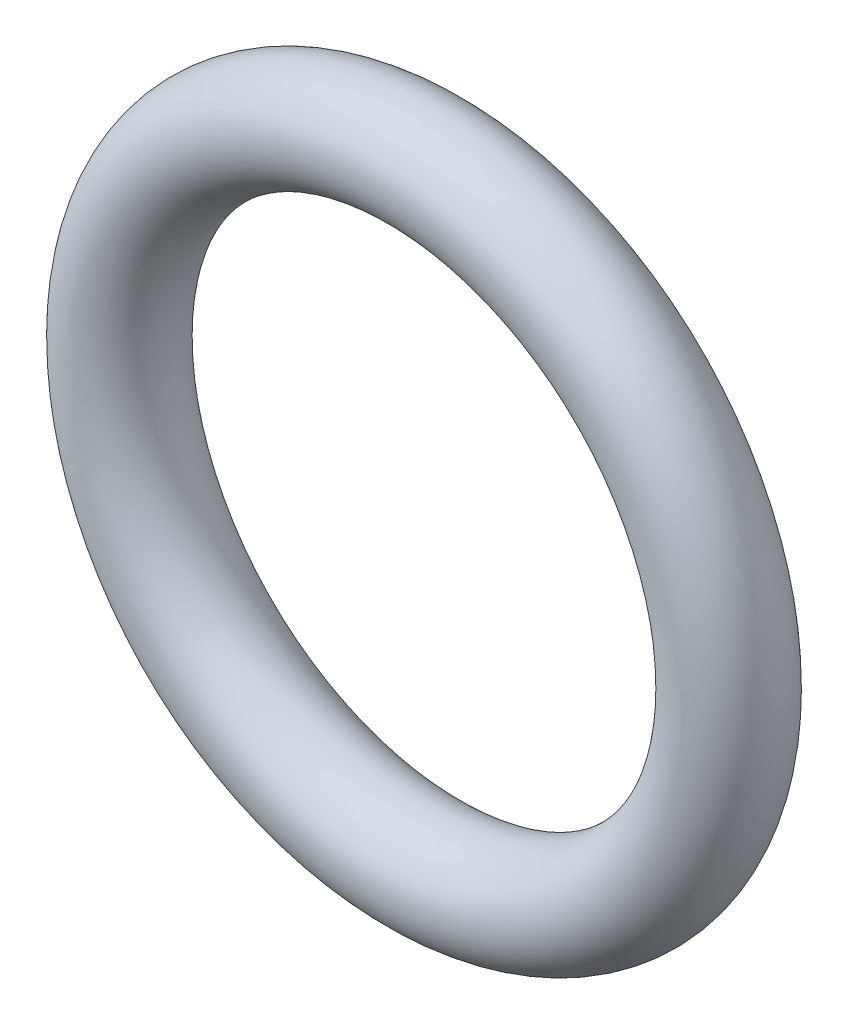
ISO-10303-21;
HEADER;
FILE_DESCRIPTION(('STEP AP214'),'2;1');
FILE_NAME('part.step','',(''),(''),'','','');
FILE_SCHEMA(('AUTOMOTIVE_DESIGN { 1 0 10303 214 1 1 1 1 }'));
ENDSEC;
DATA;
#1=APPLICATION_CONTEXT('core data for automotive mechanical design processes');
#2=APPLICATION_PROTOCOL_DEFINITION('international standard','automotive_design',2000,#1);
#3=PRODUCT_CONTEXT('',#1,'mechanical');
#4=PRODUCT('Part','Part','',(#3));
#5=PRODUCT_RELATED_PRODUCT_CATEGORY('part','',(#4));
#6=PRODUCT_DEFINITION_FORMATION('','',#4);
#7=PRODUCT_DEFINITION_CONTEXT('part definition',#1,'design');
#8=PRODUCT_DEFINITION('design','',#6,#7);
#9=PRODUCT_DEFINITION_SHAPE('','',#8);
#10=(LENGTH_UNIT() NAMED_UNIT(*) SI_UNIT(.MILLI.,.METRE.));
#11=(NAMED_UNIT(*) PLANE_ANGLE_UNIT() SI_UNIT($,.RADIAN.));
#12=(NAMED_UNIT(*) SI_UNIT($,.STERADIAN.) SOLID_ANGLE_UNIT());
#13=UNCERTAINTY_MEASURE_WITH_UNIT(LENGTH_MEASURE(1.E-05),#10,'distance_accuracy_value','');
#14=(GEOMETRIC_REPRESENTATION_CONTEXT(3) GLOBAL_UNCERTAINTY_ASSIGNED_CONTEXT((#13)) GLOBAL_UNIT_ASSIGNED_CONTEXT((#10,
#11,#12)) REPRESENTATION_CONTEXT('',''));
#15=CARTESIAN_POINT('',(0.,0.,0.));
#16=DIRECTION('',(0.,0.,1.));
#17=DIRECTION('',(1.,0.,0.));
#18=AXIS2_PLACEMENT_3D('',#15,#16,#17);
#19=CARTESIAN_POINT('',(0.,0.,0.));
#20=DIRECTION('',(0.,0.,-1.));
#21=DIRECTION('',(-1.,0.,0.));
#22=AXIS2_PLACEMENT_3D('',#19,#20,#21);
#23=TOROIDAL_SURFACE('',#22,7.1,1.2);
#24=CARTESIAN_POINT('',(-8.3,0.,0.));
#25=VERTEX_POINT('',#24);
#26=VERTEX_LOOP('',#25);
#27=FACE_BOUND('',#26,.T.);
#28=ADVANCED_FACE('F29',(#27),#23,.T.);
#29=CLOSED_SHELL('',(#28));
#30=MANIFOLD_SOLID_BREP('B2',#29);
#31=ADVANCED_BREP_SHAPE_REPRESENTATION('',(#18,#30),#14);
#32=SHAPE_DEFINITION_REPRESENTATION(#9,#31);
ENDSEC;
END-ISO-10303-21;
